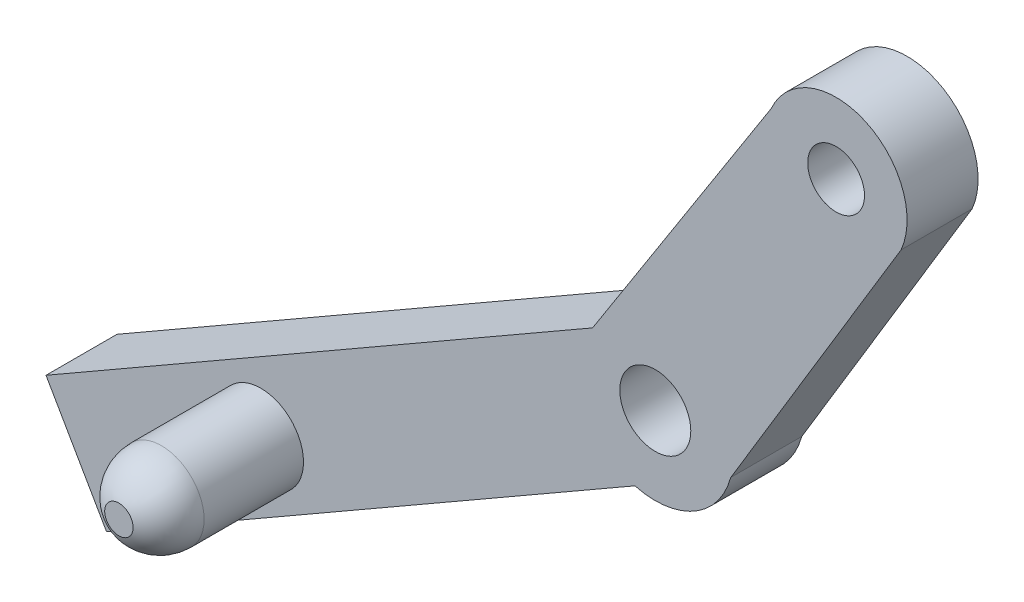
ISO-10303-21;
HEADER;
FILE_DESCRIPTION(('STEP AP214'),'2;1');
FILE_NAME('part.step','',(''),(''),'','','');
FILE_SCHEMA(('AUTOMOTIVE_DESIGN { 1 0 10303 214 1 1 1 1 }'));
ENDSEC;
DATA;
#1=APPLICATION_CONTEXT('core data for automotive mechanical design processes');
#2=APPLICATION_PROTOCOL_DEFINITION('international standard','automotive_design',2000,#1);
#3=PRODUCT_CONTEXT('',#1,'mechanical');
#4=PRODUCT('Part','Part','',(#3));
#5=PRODUCT_RELATED_PRODUCT_CATEGORY('part','',(#4));
#6=PRODUCT_DEFINITION_FORMATION('','',#4);
#7=PRODUCT_DEFINITION_CONTEXT('part definition',#1,'design');
#8=PRODUCT_DEFINITION('design','',#6,#7);
#9=PRODUCT_DEFINITION_SHAPE('','',#8);
#10=(LENGTH_UNIT() NAMED_UNIT(*) SI_UNIT(.MILLI.,.METRE.));
#11=(NAMED_UNIT(*) PLANE_ANGLE_UNIT() SI_UNIT($,.RADIAN.));
#12=(NAMED_UNIT(*) SI_UNIT($,.STERADIAN.) SOLID_ANGLE_UNIT());
#13=UNCERTAINTY_MEASURE_WITH_UNIT(LENGTH_MEASURE(1.E-05),#10,'distance_accuracy_value','');
#14=(GEOMETRIC_REPRESENTATION_CONTEXT(3) GLOBAL_UNCERTAINTY_ASSIGNED_CONTEXT((#13)) GLOBAL_UNIT_ASSIGNED_CONTEXT((#10,
#11,#12)) REPRESENTATION_CONTEXT('',''));
#15=CARTESIAN_POINT('',(0.,0.,0.));
#16=DIRECTION('',(0.,0.,1.));
#17=DIRECTION('',(1.,0.,0.));
#18=AXIS2_PLACEMENT_3D('',#15,#16,#17);
#19=CARTESIAN_POINT('',(-25.2931810081454,-19.8826359089883,15.));
#20=DIRECTION('',(0.,0.,-1.));
#21=DIRECTION('',(-1.,0.,0.));
#22=AXIS2_PLACEMENT_3D('',#19,#20,#21);
#23=CYLINDRICAL_SURFACE('',#22,3.);
#24=CARTESIAN_POINT('',(-25.2931810081454,-19.8826359089883,5.));
#25=DIRECTION('',(0.,0.,1.));
#26=DIRECTION('',(1.,0.,0.));
#27=AXIS2_PLACEMENT_3D('',#24,#25,#26);
#28=CIRCLE('',#27,3.);
#29=CARTESIAN_POINT('',(-22.2931810081454,-19.8826359089883,5.));
#30=VERTEX_POINT('',#29);
#31=EDGE_CURVE('E137',#30,#30,#28,.T.);
#32=ORIENTED_EDGE('',*,*,#31,.T.);
#33=EDGE_LOOP('',(#32));
#34=FACE_BOUND('',#33,.T.);
#35=CARTESIAN_POINT('',(-25.2931810081454,-19.8826359089884,12.));
#36=DIRECTION('',(0.,0.,1.));
#37=DIRECTION('',(1.,0.,0.));
#38=AXIS2_PLACEMENT_3D('',#35,#36,#37);
#39=CIRCLE('',#38,3.);
#40=CARTESIAN_POINT('',(-22.2931810081454,-19.8826359089884,12.));
#41=VERTEX_POINT('',#40);
#42=EDGE_CURVE('E318',#41,#41,#39,.T.);
#43=ORIENTED_EDGE('',*,*,#42,.F.);
#44=EDGE_LOOP('',(#43));
#45=FACE_BOUND('',#44,.T.);
#46=ADVANCED_FACE('F39',(#34,#45),#23,.T.);
#47=CARTESIAN_POINT('',(-0.682703439514869,0.436635830889686,5.));
#48=DIRECTION('',(-0.842436284988127,0.538795977838925,0.));
#49=DIRECTION('',(-0.538795977838925,-0.842436284988127,0.));
#50=AXIS2_PLACEMENT_3D('',#47,#48,#49);
#51=PLANE('',#50);
#52=DIRECTION('',(0.538795977838925,0.842436284988127,0.));
#53=VECTOR('',#52,1.);
#54=CARTESIAN_POINT('',(-0.682703439514869,0.436635830889686,0.));
#55=LINE('',#54,#53);
#56=CARTESIAN_POINT('',(-1.93424021867878,-1.52020875988425,0.));
#57=VERTEX_POINT('',#56);
#58=CARTESIAN_POINT('',(10.6400793801503,18.1404114466345,0.));
#59=VERTEX_POINT('',#58);
#60=EDGE_CURVE('E133',#57,#59,#55,.T.);
#61=ORIENTED_EDGE('',*,*,#60,.F.);
#62=DIRECTION('',(0.,0.,-1.));
#63=VECTOR('',#62,1.);
#64=CARTESIAN_POINT('',(-1.93424021867878,-1.52020875988425,5.));
#65=LINE('',#64,#63);
#66=CARTESIAN_POINT('',(-1.93424021867878,-1.52020875988425,5.));
#67=VERTEX_POINT('',#66);
#68=EDGE_CURVE('E12',#67,#57,#65,.T.);
#69=ORIENTED_EDGE('',*,*,#68,.F.);
#70=DIRECTION('',(0.538795977838925,0.842436284988127,0.));
#71=VECTOR('',#70,1.);
#72=CARTESIAN_POINT('',(-0.682703439514869,0.436635830889686,5.));
#73=LINE('',#72,#71);
#74=CARTESIAN_POINT('',(10.6400793801503,18.1404114466345,5.));
#75=VERTEX_POINT('',#74);
#76=EDGE_CURVE('E154',#67,#75,#73,.T.);
#77=ORIENTED_EDGE('',*,*,#76,.T.);
#78=DIRECTION('',(0.,0.,-1.));
#79=VECTOR('',#78,1.);
#80=CARTESIAN_POINT('',(10.6400793801503,18.1404114466345,5.));
#81=LINE('',#80,#79);
#82=EDGE_CURVE('E88',#75,#59,#81,.T.);
#83=ORIENTED_EDGE('',*,*,#82,.T.);
#84=EDGE_LOOP('',(#61,#69,#77,#83));
#85=FACE_BOUND('',#84,.T.);
#86=ADVANCED_FACE('F41',(#85),#51,.T.);
#87=CARTESIAN_POINT('',(0.17625658415401,-0.30648591573246,5.));
#88=DIRECTION('',(-0.498528903536302,0.866873077410351,0.));
#89=DIRECTION('',(-0.866873077410351,-0.498528903536302,0.));
#90=AXIS2_PLACEMENT_3D('',#87,#88,#89);
#91=PLANE('',#90);
#92=DIRECTION('',(0.866873077410351,0.498528903536302,0.));
#93=VECTOR('',#92,1.);
#94=CARTESIAN_POINT('',(0.17625658415401,-0.30648591573246,0.));
#95=LINE('',#94,#93);
#96=CARTESIAN_POINT('',(-40.4263847840177,-23.6566057999731,0.));
#97=VERTEX_POINT('',#96);
#98=EDGE_CURVE('E136',#97,#57,#95,.T.);
#99=ORIENTED_EDGE('',*,*,#98,.F.);
#100=DIRECTION('',(0.,0.,-1.));
#101=VECTOR('',#100,1.);
#102=CARTESIAN_POINT('',(-40.4263847840177,-23.6566057999731,5.));
#103=LINE('',#102,#101);
#104=CARTESIAN_POINT('',(-40.4263847840177,-23.6566057999731,5.));
#105=VERTEX_POINT('',#104);
#106=EDGE_CURVE('E48',#105,#97,#103,.T.);
#107=ORIENTED_EDGE('',*,*,#106,.F.);
#108=DIRECTION('',(0.866873077410351,0.498528903536302,0.));
#109=VECTOR('',#108,1.);
#110=CARTESIAN_POINT('',(0.17625658415401,-0.30648591573246,5.));
#111=LINE('',#110,#109);
#112=EDGE_CURVE('E175',#105,#67,#111,.T.);
#113=ORIENTED_EDGE('',*,*,#112,.T.);
#114=ORIENTED_EDGE('',*,*,#68,.T.);
#115=EDGE_LOOP('',(#99,#107,#113,#114));
#116=FACE_BOUND('',#115,.T.);
#117=ADVANCED_FACE('F174',(#116),#91,.T.);
#118=CARTESIAN_POINT('',(-40.6026413681717,-23.3501198842406,5.));
#119=DIRECTION('',(0.866873077410351,0.498528903536302,0.));
#120=DIRECTION('',(-0.498528903536302,0.866873077410351,0.));
#121=AXIS2_PLACEMENT_3D('',#118,#119,#120);
#122=PLANE('',#121);
#123=DIRECTION('',(0.498528903536302,-0.866873077410351,0.));
#124=VECTOR('',#123,1.);
#125=CARTESIAN_POINT('',(-40.6026413681717,-23.3501198842406,0.));
#126=LINE('',#125,#124);
#127=CARTESIAN_POINT('',(-36.1661695545836,-31.0645331240926,0.));
#128=VERTEX_POINT('',#127);
#129=EDGE_CURVE('E140',#97,#128,#126,.T.);
#130=ORIENTED_EDGE('',*,*,#129,.T.);
#131=DIRECTION('',(0.,0.,-1.));
#132=VECTOR('',#131,1.);
#133=CARTESIAN_POINT('',(-36.1661695545836,-31.0645331240926,5.));
#134=LINE('',#133,#132);
#135=CARTESIAN_POINT('',(-36.1661695545836,-31.0645331240926,5.));
#136=VERTEX_POINT('',#135);
#137=EDGE_CURVE('E158',#136,#128,#134,.T.);
#138=ORIENTED_EDGE('',*,*,#137,.F.);
#139=DIRECTION('',(0.498528903536302,-0.866873077410351,0.));
#140=VECTOR('',#139,1.);
#141=CARTESIAN_POINT('',(-40.6026413681717,-23.3501198842406,5.));
#142=LINE('',#141,#140);
#143=EDGE_CURVE('E165',#105,#136,#142,.T.);
#144=ORIENTED_EDGE('',*,*,#143,.F.);
#145=ORIENTED_EDGE('',*,*,#106,.T.);
#146=EDGE_LOOP('',(#130,#138,#144,#145));
#147=FACE_BOUND('',#146,.T.);
#148=ADVANCED_FACE('F163',(#147),#122,.F.);
#149=CARTESIAN_POINT('',(4.43647181358803,-7.71441323985198,5.));
#150=DIRECTION('',(-0.498528903536302,0.866873077410351,0.));
#151=DIRECTION('',(-0.866873077410351,-0.498528903536302,0.));
#152=AXIS2_PLACEMENT_3D('',#149,#150,#151);
#153=PLANE('',#152);
#154=DIRECTION('',(0.866873077410351,0.498528903536302,0.));
#155=VECTOR('',#154,1.);
#156=CARTESIAN_POINT('',(4.43647181358803,-7.71441323985198,0.));
#157=LINE('',#156,#155);
#158=CARTESIAN_POINT('',(1.04782478556533,-9.66318582418271,0.));
#159=VERTEX_POINT('',#158);
#160=EDGE_CURVE('E142',#128,#159,#157,.T.);
#161=ORIENTED_EDGE('',*,*,#160,.T.);
#162=DIRECTION('',(0.,0.,-1.));
#163=VECTOR('',#162,1.);
#164=CARTESIAN_POINT('',(1.04782478556533,-9.66318582418271,5.));
#165=LINE('',#164,#163);
#166=CARTESIAN_POINT('',(1.04782478556533,-9.66318582418271,5.));
#167=VERTEX_POINT('',#166);
#168=EDGE_CURVE('E119',#167,#159,#165,.T.);
#169=ORIENTED_EDGE('',*,*,#168,.F.);
#170=DIRECTION('',(0.866873077410351,0.498528903536302,0.));
#171=VECTOR('',#170,1.);
#172=CARTESIAN_POINT('',(4.43647181358803,-7.71441323985198,5.));
#173=LINE('',#172,#171);
#174=EDGE_CURVE('E110',#136,#167,#173,.T.);
#175=ORIENTED_EDGE('',*,*,#174,.F.);
#176=ORIENTED_EDGE('',*,*,#137,.T.);
#177=EDGE_LOOP('',(#161,#169,#175,#176));
#178=FACE_BOUND('',#177,.T.);
#179=ADVANCED_FACE('F185',(#178),#153,.F.);
#180=CARTESIAN_POINT('',(2.48034743292827,-4.35301832543163,5.));
#181=DIRECTION('',(0.,0.,-1.));
#182=DIRECTION('',(-1.,0.,0.));
#183=AXIS2_PLACEMENT_3D('',#180,#181,#182);
#184=CYLINDRICAL_SURFACE('',#183,5.5);
#185=CARTESIAN_POINT('',(2.48034743292827,-4.35301832543163,0.));
#186=DIRECTION('',(0.,0.,1.));
#187=DIRECTION('',(1.,0.,0.));
#188=AXIS2_PLACEMENT_3D('',#185,#186,#187);
#189=CIRCLE('',#188,5.5);
#190=CARTESIAN_POINT('',(7.79051493167935,-5.78554097279456,0.));
#191=VERTEX_POINT('',#190);
#192=EDGE_CURVE('E118',#159,#191,#189,.T.);
#193=ORIENTED_EDGE('',*,*,#192,.T.);
#194=DIRECTION('',(0.,0.,-1.));
#195=VECTOR('',#194,1.);
#196=CARTESIAN_POINT('',(7.79051493167935,-5.78554097279456,5.));
#197=LINE('',#196,#195);
#198=CARTESIAN_POINT('',(7.79051493167935,-5.78554097279456,5.));
#199=VERTEX_POINT('',#198);
#200=EDGE_CURVE('E115',#199,#191,#197,.T.);
#201=ORIENTED_EDGE('',*,*,#200,.F.);
#202=CARTESIAN_POINT('',(2.48034743292827,-4.35301832543163,5.));
#203=DIRECTION('',(0.,0.,1.));
#204=DIRECTION('',(1.,0.,0.));
#205=AXIS2_PLACEMENT_3D('',#202,#203,#204);
#206=CIRCLE('',#205,5.5);
#207=EDGE_CURVE('E103',#167,#199,#206,.T.);
#208=ORIENTED_EDGE('',*,*,#207,.F.);
#209=ORIENTED_EDGE('',*,*,#168,.T.);
#210=EDGE_LOOP('',(#193,#201,#208,#209));
#211=FACE_BOUND('',#210,.T.);
#212=ADVANCED_FACE('F116',(#211),#184,.T.);
#213=CARTESIAN_POINT('',(8.27057905312399,-4.98984292672802,5.));
#214=DIRECTION('',(-0.856234541670631,0.51658727205583,0.));
#215=DIRECTION('',(-0.51658727205583,-0.856234541670632,0.));
#216=AXIS2_PLACEMENT_3D('',#213,#214,#215);
#217=PLANE('',#216);
#218=DIRECTION('',(0.51658727205583,0.856234541670631,0.));
#219=VECTOR('',#218,1.);
#220=CARTESIAN_POINT('',(8.27057905312399,-4.98984292672802,0.));
#221=LINE('',#220,#219);
#222=CARTESIAN_POINT('',(19.7862245967424,14.097142017446,0.));
#223=VERTEX_POINT('',#222);
#224=EDGE_CURVE('E81',#191,#223,#221,.T.);
#225=ORIENTED_EDGE('',*,*,#224,.T.);
#226=DIRECTION('',(0.,0.,-1.));
#227=VECTOR('',#226,1.);
#228=CARTESIAN_POINT('',(19.7862245967424,14.097142017446,5.));
#229=LINE('',#228,#227);
#230=CARTESIAN_POINT('',(19.7862245967424,14.097142017446,5.));
#231=VERTEX_POINT('',#230);
#232=EDGE_CURVE('E120',#231,#223,#229,.T.);
#233=ORIENTED_EDGE('',*,*,#232,.F.);
#234=DIRECTION('',(0.51658727205583,0.856234541670631,0.));
#235=VECTOR('',#234,1.);
#236=CARTESIAN_POINT('',(8.27057905312399,-4.98984292672802,5.));
#237=LINE('',#236,#235);
#238=EDGE_CURVE('E108',#199,#231,#237,.T.);
#239=ORIENTED_EDGE('',*,*,#238,.F.);
#240=ORIENTED_EDGE('',*,*,#200,.T.);
#241=EDGE_LOOP('',(#225,#233,#239,#240));
#242=FACE_BOUND('',#241,.T.);
#243=ADVANCED_FACE('F122',(#242),#217,.F.);
#244=CARTESIAN_POINT('',(15.2131519884464,16.1187767320402,5.));
#245=DIRECTION('',(0.,0.,-1.));
#246=DIRECTION('',(-1.,0.,0.));
#247=AXIS2_PLACEMENT_3D('',#244,#245,#246);
#248=CYLINDRICAL_SURFACE('',#247,2.);
#249=CARTESIAN_POINT('',(15.2131519884464,16.1187767320402,5.));
#250=DIRECTION('',(0.,0.,1.));
#251=DIRECTION('',(1.,0.,0.));
#252=AXIS2_PLACEMENT_3D('',#249,#250,#251);
#253=CIRCLE('',#252,2.);
#254=CARTESIAN_POINT('',(17.2131519884464,16.1187767320402,5.));
#255=VERTEX_POINT('',#254);
#256=EDGE_CURVE('E124',#255,#255,#253,.T.);
#257=ORIENTED_EDGE('',*,*,#256,.T.);
#258=EDGE_LOOP('',(#257));
#259=FACE_BOUND('',#258,.T.);
#260=CARTESIAN_POINT('',(15.2131519884464,16.1187767320402,0.));
#261=DIRECTION('',(0.,0.,1.));
#262=DIRECTION('',(1.,0.,0.));
#263=AXIS2_PLACEMENT_3D('',#260,#261,#262);
#264=CIRCLE('',#263,2.);
#265=CARTESIAN_POINT('',(17.2131519884464,16.1187767320402,0.));
#266=VERTEX_POINT('',#265);
#267=EDGE_CURVE('E148',#266,#266,#264,.T.);
#268=ORIENTED_EDGE('',*,*,#267,.F.);
#269=EDGE_LOOP('',(#268));
#270=FACE_BOUND('',#269,.T.);
#271=ADVANCED_FACE('F216',(#259,#270),#248,.F.);
#272=CARTESIAN_POINT('',(15.2131519884464,16.1187767320402,5.));
#273=DIRECTION('',(0.,0.,-1.));
#274=DIRECTION('',(-1.,0.,0.));
#275=AXIS2_PLACEMENT_3D('',#272,#273,#274);
#276=CYLINDRICAL_SURFACE('',#275,5.);
#277=CARTESIAN_POINT('',(15.2131519884464,16.1187767320402,0.));
#278=DIRECTION('',(0.,0.,1.));
#279=DIRECTION('',(1.,0.,0.));
#280=AXIS2_PLACEMENT_3D('',#277,#278,#279);
#281=CIRCLE('',#280,5.);
#282=EDGE_CURVE('E146',#223,#59,#281,.T.);
#283=ORIENTED_EDGE('',*,*,#282,.T.);
#284=ORIENTED_EDGE('',*,*,#82,.F.);
#285=CARTESIAN_POINT('',(15.2131519884464,16.1187767320402,5.));
#286=DIRECTION('',(0.,0.,1.));
#287=DIRECTION('',(1.,0.,0.));
#288=AXIS2_PLACEMENT_3D('',#285,#286,#287);
#289=CIRCLE('',#288,5.);
#290=EDGE_CURVE('E56',#231,#75,#289,.T.);
#291=ORIENTED_EDGE('',*,*,#290,.F.);
#292=ORIENTED_EDGE('',*,*,#232,.T.);
#293=EDGE_LOOP('',(#283,#284,#291,#292));
#294=FACE_BOUND('',#293,.T.);
#295=ADVANCED_FACE('F178',(#294),#276,.T.);
#296=CARTESIAN_POINT('',(2.48034743292827,-4.35301832543163,5.));
#297=DIRECTION('',(0.,0.,-1.));
#298=DIRECTION('',(-1.,0.,0.));
#299=AXIS2_PLACEMENT_3D('',#296,#297,#298);
#300=CYLINDRICAL_SURFACE('',#299,2.5);
#301=CARTESIAN_POINT('',(2.48034743292827,-4.35301832543163,5.));
#302=DIRECTION('',(0.,0.,1.));
#303=DIRECTION('',(1.,0.,0.));
#304=AXIS2_PLACEMENT_3D('',#301,#302,#303);
#305=CIRCLE('',#304,2.5);
#306=CARTESIAN_POINT('',(4.98034743292827,-4.35301832543163,5.));
#307=VERTEX_POINT('',#306);
#308=EDGE_CURVE('E130',#307,#307,#305,.T.);
#309=ORIENTED_EDGE('',*,*,#308,.T.);
#310=EDGE_LOOP('',(#309));
#311=FACE_BOUND('',#310,.T.);
#312=CARTESIAN_POINT('',(2.48034743292827,-4.35301832543163,0.));
#313=DIRECTION('',(0.,0.,1.));
#314=DIRECTION('',(1.,0.,0.));
#315=AXIS2_PLACEMENT_3D('',#312,#313,#314);
#316=CIRCLE('',#315,2.5);
#317=CARTESIAN_POINT('',(4.98034743292827,-4.35301832543163,0.));
#318=VERTEX_POINT('',#317);
#319=EDGE_CURVE('E151',#318,#318,#316,.T.);
#320=ORIENTED_EDGE('',*,*,#319,.F.);
#321=EDGE_LOOP('',(#320));
#322=FACE_BOUND('',#321,.T.);
#323=ADVANCED_FACE('F208',(#311,#322),#300,.F.);
#324=CARTESIAN_POINT('',(0.,0.,5.));
#325=DIRECTION('',(0.,0.,1.));
#326=DIRECTION('',(1.,0.,0.));
#327=AXIS2_PLACEMENT_3D('',#324,#325,#326);
#328=PLANE('',#327);
#329=ORIENTED_EDGE('',*,*,#31,.F.);
#330=EDGE_LOOP('',(#329));
#331=FACE_BOUND('',#330,.T.);
#332=ORIENTED_EDGE('',*,*,#76,.F.);
#333=ORIENTED_EDGE('',*,*,#112,.F.);
#334=ORIENTED_EDGE('',*,*,#143,.T.);
#335=ORIENTED_EDGE('',*,*,#174,.T.);
#336=ORIENTED_EDGE('',*,*,#207,.T.);
#337=ORIENTED_EDGE('',*,*,#238,.T.);
#338=ORIENTED_EDGE('',*,*,#290,.T.);
#339=EDGE_LOOP('',(#332,#333,#334,#335,#336,#337,#338));
#340=FACE_BOUND('',#339,.T.);
#341=ORIENTED_EDGE('',*,*,#256,.F.);
#342=EDGE_LOOP('',(#341));
#343=FACE_BOUND('',#342,.T.);
#344=ORIENTED_EDGE('',*,*,#308,.F.);
#345=EDGE_LOOP('',(#344));
#346=FACE_BOUND('',#345,.T.);
#347=ADVANCED_FACE('F105',(#331,#340,#343,#346),#328,.T.);
#348=CARTESIAN_POINT('',(0.,0.,0.));
#349=DIRECTION('',(0.,0.,1.));
#350=DIRECTION('',(1.,0.,0.));
#351=AXIS2_PLACEMENT_3D('',#348,#349,#350);
#352=PLANE('',#351);
#353=ORIENTED_EDGE('',*,*,#60,.T.);
#354=ORIENTED_EDGE('',*,*,#282,.F.);
#355=ORIENTED_EDGE('',*,*,#224,.F.);
#356=ORIENTED_EDGE('',*,*,#192,.F.);
#357=ORIENTED_EDGE('',*,*,#160,.F.);
#358=ORIENTED_EDGE('',*,*,#129,.F.);
#359=ORIENTED_EDGE('',*,*,#98,.T.);
#360=EDGE_LOOP('',(#353,#354,#355,#356,#357,#358,#359));
#361=FACE_BOUND('',#360,.T.);
#362=ORIENTED_EDGE('',*,*,#267,.T.);
#363=EDGE_LOOP('',(#362));
#364=FACE_BOUND('',#363,.T.);
#365=ORIENTED_EDGE('',*,*,#319,.T.);
#366=EDGE_LOOP('',(#365));
#367=FACE_BOUND('',#366,.T.);
#368=ADVANCED_FACE('F172',(#361,#364,#367),#352,.F.);
#369=CARTESIAN_POINT('',(-25.2931810081454,-19.8826359089884,12.));
#370=DIRECTION('',(0.,0.,1.));
#371=DIRECTION('',(1.,0.,0.));
#372=AXIS2_PLACEMENT_3D('',#369,#370,#371);
#373=DEGENERATE_TOROIDAL_SURFACE('',#372,0.250000000000002,3.25,.F.);
#374=ORIENTED_EDGE('',*,*,#42,.T.);
#375=EDGE_LOOP('',(#374));
#376=FACE_BOUND('',#375,.T.);
#377=CARTESIAN_POINT('',(-25.2931810081454,-19.8826359089884,15.));
#378=DIRECTION('',(0.,0.,1.));
#379=DIRECTION('',(1.,0.,0.));
#380=AXIS2_PLACEMENT_3D('',#377,#378,#379);
#381=CIRCLE('',#380,0.999999999999999);
#382=CARTESIAN_POINT('',(-24.2931810081454,-19.8826359089884,15.));
#383=VERTEX_POINT('',#382);
#384=EDGE_CURVE('E316',#383,#383,#381,.T.);
#385=ORIENTED_EDGE('',*,*,#384,.F.);
#386=EDGE_LOOP('',(#385));
#387=FACE_BOUND('',#386,.T.);
#388=ADVANCED_FACE('F212',(#376,#387),#373,.F.);
#389=CARTESIAN_POINT('',(-25.2931810081454,-19.8826359089883,15.));
#390=DIRECTION('',(0.,0.,1.));
#391=DIRECTION('',(1.,0.,0.));
#392=AXIS2_PLACEMENT_3D('',#389,#390,#391);
#393=PLANE('',#392);
#394=ORIENTED_EDGE('',*,*,#384,.T.);
#395=EDGE_LOOP('',(#394));
#396=FACE_BOUND('',#395,.T.);
#397=ADVANCED_FACE('F204',(#396),#393,.T.);
#398=CLOSED_SHELL('',(#46,#86,#117,#148,#179,#212,#243,#271,#295,#323,#347,#368,#388,#397));
#399=MANIFOLD_SOLID_BREP('B2',#398);
#400=ADVANCED_BREP_SHAPE_REPRESENTATION('',(#18,#399),#14);
#401=SHAPE_DEFINITION_REPRESENTATION(#9,#400);
ENDSEC;
END-ISO-10303-21;
